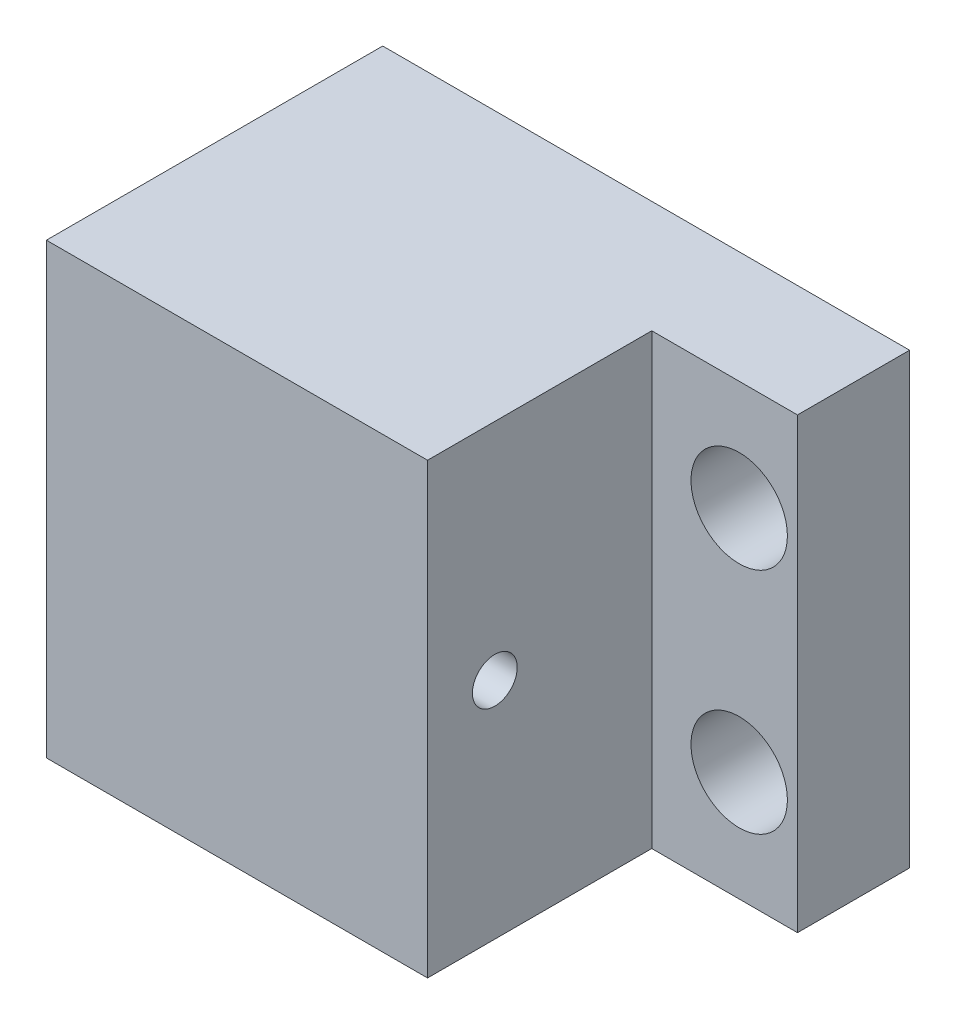
ISO-10303-21;
HEADER;
FILE_DESCRIPTION(('STEP AP214'),'2;1');
FILE_NAME('part.step','',(''),(''),'','','');
FILE_SCHEMA(('AUTOMOTIVE_DESIGN { 1 0 10303 214 1 1 1 1 }'));
ENDSEC;
DATA;
#1=APPLICATION_CONTEXT('core data for automotive mechanical design processes');
#2=APPLICATION_PROTOCOL_DEFINITION('international standard','automotive_design',2000,#1);
#3=PRODUCT_CONTEXT('',#1,'mechanical');
#4=PRODUCT('Part','Part','',(#3));
#5=PRODUCT_RELATED_PRODUCT_CATEGORY('part','',(#4));
#6=PRODUCT_DEFINITION_FORMATION('','',#4);
#7=PRODUCT_DEFINITION_CONTEXT('part definition',#1,'design');
#8=PRODUCT_DEFINITION('design','',#6,#7);
#9=PRODUCT_DEFINITION_SHAPE('','',#8);
#10=(LENGTH_UNIT() NAMED_UNIT(*) SI_UNIT(.MILLI.,.METRE.));
#11=(NAMED_UNIT(*) PLANE_ANGLE_UNIT() SI_UNIT($,.RADIAN.));
#12=(NAMED_UNIT(*) SI_UNIT($,.STERADIAN.) SOLID_ANGLE_UNIT());
#13=UNCERTAINTY_MEASURE_WITH_UNIT(LENGTH_MEASURE(1.E-05),#10,'distance_accuracy_value','');
#14=(GEOMETRIC_REPRESENTATION_CONTEXT(3) GLOBAL_UNCERTAINTY_ASSIGNED_CONTEXT((#13)) GLOBAL_UNIT_ASSIGNED_CONTEXT((#10,
#11,#12)) REPRESENTATION_CONTEXT('',''));
#15=CARTESIAN_POINT('',(0.,0.,0.));
#16=DIRECTION('',(0.,0.,1.));
#17=DIRECTION('',(1.,0.,0.));
#18=AXIS2_PLACEMENT_3D('',#15,#16,#17);
#19=CARTESIAN_POINT('',(0.,0.,5.));
#20=DIRECTION('',(0.,0.,-1.));
#21=DIRECTION('',(-1.,0.,0.));
#22=AXIS2_PLACEMENT_3D('',#19,#20,#21);
#23=PLANE('',#22);
#24=CARTESIAN_POINT('',(8.79749455337726,12.789651416122,5.));
#25=DIRECTION('',(0.,0.,1.));
#26=DIRECTION('',(1.,0.,0.));
#27=AXIS2_PLACEMENT_3D('',#24,#25,#26);
#28=CIRCLE('',#27,2.1499999999997);
#29=CARTESIAN_POINT('',(10.947494553377,12.789651416122,5.));
#30=VERTEX_POINT('',#29);
#31=EDGE_CURVE('E472',#30,#30,#28,.T.);
#32=ORIENTED_EDGE('',*,*,#31,.F.);
#33=EDGE_LOOP('',(#32));
#34=FACE_BOUND('',#33,.T.);
#35=CARTESIAN_POINT('',(8.79749455337726,22.989651416122,5.));
#36=DIRECTION('',(0.,0.,1.));
#37=DIRECTION('',(1.,0.,0.));
#38=AXIS2_PLACEMENT_3D('',#35,#36,#37);
#39=CIRCLE('',#38,2.1499999999997);
#40=CARTESIAN_POINT('',(10.947494553377,22.989651416122,5.));
#41=VERTEX_POINT('',#40);
#42=EDGE_CURVE('E466',#41,#41,#39,.T.);
#43=ORIENTED_EDGE('',*,*,#42,.F.);
#44=EDGE_LOOP('',(#43));
#45=FACE_BOUND('',#44,.T.);
#46=DIRECTION('',(0.,1.,0.));
#47=VECTOR('',#46,1.);
#48=CARTESIAN_POINT('',(4.89749455337726,7.88965141612197,5.));
#49=LINE('',#48,#47);
#50=CARTESIAN_POINT('',(4.89749455337726,7.88965141612197,5.));
#51=VERTEX_POINT('',#50);
#52=CARTESIAN_POINT('',(4.89749455337726,27.889651416122,5.));
#53=VERTEX_POINT('',#52);
#54=EDGE_CURVE('E48',#51,#53,#49,.T.);
#55=ORIENTED_EDGE('',*,*,#54,.F.);
#56=DIRECTION('',(1.,0.,0.));
#57=VECTOR('',#56,1.);
#58=CARTESIAN_POINT('',(-12.1025054466231,7.88965141612197,5.));
#59=LINE('',#58,#57);
#60=CARTESIAN_POINT('',(11.3974945533769,7.88965141612197,5.));
#61=VERTEX_POINT('',#60);
#62=EDGE_CURVE('E104',#51,#61,#59,.T.);
#63=ORIENTED_EDGE('',*,*,#62,.T.);
#64=DIRECTION('',(0.,1.,0.));
#65=VECTOR('',#64,1.);
#66=CARTESIAN_POINT('',(11.3974945533769,7.88965141612197,5.));
#67=LINE('',#66,#65);
#68=CARTESIAN_POINT('',(11.3974945533769,27.889651416122,5.));
#69=VERTEX_POINT('',#68);
#70=EDGE_CURVE('E211',#61,#69,#67,.T.);
#71=ORIENTED_EDGE('',*,*,#70,.T.);
#72=DIRECTION('',(-1.,0.,0.));
#73=VECTOR('',#72,1.);
#74=CARTESIAN_POINT('',(-12.1025054466231,27.889651416122,5.));
#75=LINE('',#74,#73);
#76=EDGE_CURVE('E260',#69,#53,#75,.T.);
#77=ORIENTED_EDGE('',*,*,#76,.T.);
#78=EDGE_LOOP('',(#55,#63,#71,#77));
#79=FACE_BOUND('',#78,.T.);
#80=ADVANCED_FACE('F33',(#34,#45,#79),#23,.F.);
#81=CARTESIAN_POINT('',(-12.1025054466231,7.88965141612197,5.));
#82=DIRECTION('',(0.,1.,0.));
#83=DIRECTION('',(0.,0.,1.));
#84=AXIS2_PLACEMENT_3D('',#81,#82,#83);
#85=PLANE('',#84);
#86=DIRECTION('',(1.,0.,0.));
#87=VECTOR('',#86,1.);
#88=CARTESIAN_POINT('',(-12.1025054466231,7.88965141612197,0.));
#89=LINE('',#88,#87);
#90=CARTESIAN_POINT('',(-12.1025054466231,7.88965141612197,0.));
#91=VERTEX_POINT('',#90);
#92=CARTESIAN_POINT('',(11.3974945533769,7.88965141612197,0.));
#93=VERTEX_POINT('',#92);
#94=EDGE_CURVE('E164',#91,#93,#89,.T.);
#95=ORIENTED_EDGE('',*,*,#94,.T.);
#96=DIRECTION('',(0.,0.,-1.));
#97=VECTOR('',#96,1.);
#98=CARTESIAN_POINT('',(11.3974945533769,7.88965141612197,5.));
#99=LINE('',#98,#97);
#100=EDGE_CURVE('E41',#61,#93,#99,.T.);
#101=ORIENTED_EDGE('',*,*,#100,.F.);
#102=ORIENTED_EDGE('',*,*,#62,.F.);
#103=DIRECTION('',(0.,0.,-1.));
#104=VECTOR('',#103,1.);
#105=CARTESIAN_POINT('',(4.89749455337726,7.88965141612197,15.));
#106=LINE('',#105,#104);
#107=CARTESIAN_POINT('',(4.89749455337726,7.88965141612197,15.));
#108=VERTEX_POINT('',#107);
#109=EDGE_CURVE('E165',#108,#51,#106,.T.);
#110=ORIENTED_EDGE('',*,*,#109,.F.);
#111=DIRECTION('',(1.,0.,0.));
#112=VECTOR('',#111,1.);
#113=CARTESIAN_POINT('',(-12.1025054466231,7.88965141612197,15.));
#114=LINE('',#113,#112);
#115=CARTESIAN_POINT('',(-12.1025054466231,7.88965141612197,15.));
#116=VERTEX_POINT('',#115);
#117=EDGE_CURVE('E236',#116,#108,#114,.T.);
#118=ORIENTED_EDGE('',*,*,#117,.F.);
#119=DIRECTION('',(0.,0.,-1.));
#120=VECTOR('',#119,1.);
#121=CARTESIAN_POINT('',(-12.1025054466231,7.88965141612197,5.));
#122=LINE('',#121,#120);
#123=EDGE_CURVE('E11',#116,#91,#122,.T.);
#124=ORIENTED_EDGE('',*,*,#123,.T.);
#125=EDGE_LOOP('',(#95,#101,#102,#110,#118,#124));
#126=FACE_BOUND('',#125,.T.);
#127=ADVANCED_FACE('F35',(#126),#85,.F.);
#128=CARTESIAN_POINT('',(11.3974945533769,7.88965141612197,5.));
#129=DIRECTION('',(-1.,0.,0.));
#130=DIRECTION('',(0.,0.,1.));
#131=AXIS2_PLACEMENT_3D('',#128,#129,#130);
#132=PLANE('',#131);
#133=DIRECTION('',(0.,1.,0.));
#134=VECTOR('',#133,1.);
#135=CARTESIAN_POINT('',(11.3974945533769,7.88965141612197,0.));
#136=LINE('',#135,#134);
#137=CARTESIAN_POINT('',(11.3974945533769,27.889651416122,0.));
#138=VERTEX_POINT('',#137);
#139=EDGE_CURVE('E167',#93,#138,#136,.T.);
#140=ORIENTED_EDGE('',*,*,#139,.T.);
#141=DIRECTION('',(0.,0.,-1.));
#142=VECTOR('',#141,1.);
#143=CARTESIAN_POINT('',(11.3974945533769,27.889651416122,5.));
#144=LINE('',#143,#142);
#145=EDGE_CURVE('E203',#69,#138,#144,.T.);
#146=ORIENTED_EDGE('',*,*,#145,.F.);
#147=ORIENTED_EDGE('',*,*,#70,.F.);
#148=ORIENTED_EDGE('',*,*,#100,.T.);
#149=EDGE_LOOP('',(#140,#146,#147,#148));
#150=FACE_BOUND('',#149,.T.);
#151=ADVANCED_FACE('F209',(#150),#132,.F.);
#152=CARTESIAN_POINT('',(-12.1025054466231,27.889651416122,5.));
#153=DIRECTION('',(0.,-1.,0.));
#154=DIRECTION('',(0.,0.,-1.));
#155=AXIS2_PLACEMENT_3D('',#152,#153,#154);
#156=PLANE('',#155);
#157=DIRECTION('',(-1.,0.,0.));
#158=VECTOR('',#157,1.);
#159=CARTESIAN_POINT('',(-12.1025054466231,27.889651416122,0.));
#160=LINE('',#159,#158);
#161=CARTESIAN_POINT('',(-12.1025054466231,27.889651416122,0.));
#162=VERTEX_POINT('',#161);
#163=EDGE_CURVE('E169',#138,#162,#160,.T.);
#164=ORIENTED_EDGE('',*,*,#163,.T.);
#165=DIRECTION('',(0.,0.,-1.));
#166=VECTOR('',#165,1.);
#167=CARTESIAN_POINT('',(-12.1025054466231,27.889651416122,5.));
#168=LINE('',#167,#166);
#169=CARTESIAN_POINT('',(-12.1025054466231,27.889651416122,15.));
#170=VERTEX_POINT('',#169);
#171=EDGE_CURVE('E200',#170,#162,#168,.T.);
#172=ORIENTED_EDGE('',*,*,#171,.F.);
#173=DIRECTION('',(-1.,0.,0.));
#174=VECTOR('',#173,1.);
#175=CARTESIAN_POINT('',(-12.1025054466231,27.889651416122,15.));
#176=LINE('',#175,#174);
#177=CARTESIAN_POINT('',(4.89749455337726,27.889651416122,15.));
#178=VERTEX_POINT('',#177);
#179=EDGE_CURVE('E248',#178,#170,#176,.T.);
#180=ORIENTED_EDGE('',*,*,#179,.F.);
#181=DIRECTION('',(0.,0.,-1.));
#182=VECTOR('',#181,1.);
#183=CARTESIAN_POINT('',(4.89749455337726,27.889651416122,15.));
#184=LINE('',#183,#182);
#185=EDGE_CURVE('E250',#178,#53,#184,.T.);
#186=ORIENTED_EDGE('',*,*,#185,.T.);
#187=ORIENTED_EDGE('',*,*,#76,.F.);
#188=ORIENTED_EDGE('',*,*,#145,.T.);
#189=EDGE_LOOP('',(#164,#172,#180,#186,#187,#188));
#190=FACE_BOUND('',#189,.T.);
#191=ADVANCED_FACE('F221',(#190),#156,.F.);
#192=CARTESIAN_POINT('',(-12.1025054466231,27.889651416122,5.));
#193=DIRECTION('',(1.,0.,0.));
#194=DIRECTION('',(0.,0.,-1.));
#195=AXIS2_PLACEMENT_3D('',#192,#193,#194);
#196=PLANE('',#195);
#197=CARTESIAN_POINT('',(-12.1025054466231,17.889651416122,11.9999999999991));
#198=DIRECTION('',(1.,0.,0.));
#199=DIRECTION('',(0.,0.,-1.));
#200=AXIS2_PLACEMENT_3D('',#197,#198,#199);
#201=CIRCLE('',#200,0.999999999999231);
#202=CARTESIAN_POINT('',(-12.1025054466231,17.889651416122,10.9999999999998));
#203=VERTEX_POINT('',#202);
#204=EDGE_CURVE('E252',#203,#203,#201,.T.);
#205=ORIENTED_EDGE('',*,*,#204,.T.);
#206=EDGE_LOOP('',(#205));
#207=FACE_BOUND('',#206,.T.);
#208=DIRECTION('',(0.,-1.,0.));
#209=VECTOR('',#208,1.);
#210=CARTESIAN_POINT('',(-12.1025054466231,27.889651416122,0.));
#211=LINE('',#210,#209);
#212=CARTESIAN_POINT('',(-12.1025054466231,26.889651416122,0.));
#213=VERTEX_POINT('',#212);
#214=EDGE_CURVE('E171',#162,#213,#211,.T.);
#215=ORIENTED_EDGE('',*,*,#214,.T.);
#216=DIRECTION('',(0.,0.,-1.));
#217=VECTOR('',#216,1.);
#218=CARTESIAN_POINT('',(-12.1025054466231,26.889651416122,5.));
#219=LINE('',#218,#217);
#220=CARTESIAN_POINT('',(-12.1025054466231,26.889651416122,5.));
#221=VERTEX_POINT('',#220);
#222=EDGE_CURVE('E197',#221,#213,#219,.T.);
#223=ORIENTED_EDGE('',*,*,#222,.F.);
#224=DIRECTION('',(0.,-1.,0.));
#225=VECTOR('',#224,1.);
#226=CARTESIAN_POINT('',(-12.1025054466231,7.88965141612197,5.));
#227=LINE('',#226,#225);
#228=CARTESIAN_POINT('',(-12.1025054466231,8.88965141612198,5.));
#229=VERTEX_POINT('',#228);
#230=EDGE_CURVE('E240',#221,#229,#227,.T.);
#231=ORIENTED_EDGE('',*,*,#230,.T.);
#232=DIRECTION('',(0.,0.,-1.));
#233=VECTOR('',#232,1.);
#234=CARTESIAN_POINT('',(-12.1025054466231,8.88965141612198,5.));
#235=LINE('',#234,#233);
#236=CARTESIAN_POINT('',(-12.1025054466231,8.88965141612198,0.));
#237=VERTEX_POINT('',#236);
#238=EDGE_CURVE('E57',#229,#237,#235,.T.);
#239=ORIENTED_EDGE('',*,*,#238,.T.);
#240=DIRECTION('',(0.,-1.,0.));
#241=VECTOR('',#240,1.);
#242=CARTESIAN_POINT('',(-12.1025054466231,7.88965141612197,0.));
#243=LINE('',#242,#241);
#244=EDGE_CURVE('E161',#237,#91,#243,.T.);
#245=ORIENTED_EDGE('',*,*,#244,.T.);
#246=ORIENTED_EDGE('',*,*,#123,.F.);
#247=DIRECTION('',(0.,-1.,0.));
#248=VECTOR('',#247,1.);
#249=CARTESIAN_POINT('',(-12.1025054466231,7.88965141612197,15.));
#250=LINE('',#249,#248);
#251=EDGE_CURVE('E230',#170,#116,#250,.T.);
#252=ORIENTED_EDGE('',*,*,#251,.F.);
#253=ORIENTED_EDGE('',*,*,#171,.T.);
#254=EDGE_LOOP('',(#215,#223,#231,#239,#245,#246,#252,#253));
#255=FACE_BOUND('',#254,.T.);
#256=ADVANCED_FACE('F227',(#207,#255),#196,.F.);
#257=CARTESIAN_POINT('',(-0.102505446623078,26.889651416122,5.));
#258=DIRECTION('',(0.,1.,0.));
#259=DIRECTION('',(0.,0.,1.));
#260=AXIS2_PLACEMENT_3D('',#257,#258,#259);
#261=PLANE('',#260);
#262=DIRECTION('',(1.,0.,0.));
#263=VECTOR('',#262,1.);
#264=CARTESIAN_POINT('',(-0.102505446623078,26.889651416122,0.));
#265=LINE('',#264,#263);
#266=CARTESIAN_POINT('',(-0.102505446623078,26.889651416122,0.));
#267=VERTEX_POINT('',#266);
#268=EDGE_CURVE('E173',#213,#267,#265,.T.);
#269=ORIENTED_EDGE('',*,*,#268,.T.);
#270=DIRECTION('',(0.,0.,-1.));
#271=VECTOR('',#270,1.);
#272=CARTESIAN_POINT('',(-0.102505446623078,26.889651416122,5.));
#273=LINE('',#272,#271);
#274=CARTESIAN_POINT('',(-0.102505446623078,26.889651416122,5.));
#275=VERTEX_POINT('',#274);
#276=EDGE_CURVE('E194',#275,#267,#273,.T.);
#277=ORIENTED_EDGE('',*,*,#276,.F.);
#278=DIRECTION('',(1.,0.,0.));
#279=VECTOR('',#278,1.);
#280=CARTESIAN_POINT('',(-0.102505446623078,26.889651416122,5.));
#281=LINE('',#280,#279);
#282=EDGE_CURVE('E262',#221,#275,#281,.T.);
#283=ORIENTED_EDGE('',*,*,#282,.F.);
#284=ORIENTED_EDGE('',*,*,#222,.T.);
#285=EDGE_LOOP('',(#269,#277,#283,#284));
#286=FACE_BOUND('',#285,.T.);
#287=ADVANCED_FACE('F278',(#286),#261,.F.);
#288=CARTESIAN_POINT('',(-0.102505446622967,22.9886709297148,5.));
#289=DIRECTION('',(1.,0.,0.));
#290=DIRECTION('',(0.,1.,0.));
#291=AXIS2_PLACEMENT_3D('',#288,#289,#290);
#292=PLANE('',#291);
#293=DIRECTION('',(0.,-1.,0.));
#294=VECTOR('',#293,1.);
#295=CARTESIAN_POINT('',(-0.102505446622967,22.9886709297148,0.));
#296=LINE('',#295,#294);
#297=CARTESIAN_POINT('',(-0.102505446622967,22.9886709297148,0.));
#298=VERTEX_POINT('',#297);
#299=EDGE_CURVE('E175',#267,#298,#296,.T.);
#300=ORIENTED_EDGE('',*,*,#299,.T.);
#301=DIRECTION('',(0.,0.,-1.));
#302=VECTOR('',#301,1.);
#303=CARTESIAN_POINT('',(-0.102505446622967,22.9886709297148,5.));
#304=LINE('',#303,#302);
#305=CARTESIAN_POINT('',(-0.102505446622967,22.9886709297148,5.));
#306=VERTEX_POINT('',#305);
#307=EDGE_CURVE('E191',#306,#298,#304,.T.);
#308=ORIENTED_EDGE('',*,*,#307,.F.);
#309=DIRECTION('',(0.,-1.,0.));
#310=VECTOR('',#309,1.);
#311=CARTESIAN_POINT('',(-0.102505446622967,22.9886709297148,5.));
#312=LINE('',#311,#310);
#313=EDGE_CURVE('E265',#275,#306,#312,.T.);
#314=ORIENTED_EDGE('',*,*,#313,.F.);
#315=ORIENTED_EDGE('',*,*,#276,.T.);
#316=EDGE_LOOP('',(#300,#308,#314,#315));
#317=FACE_BOUND('',#316,.T.);
#318=ADVANCED_FACE('F281',(#317),#292,.F.);
#319=CARTESIAN_POINT('',(1.89749455337692,22.9886709297148,5.));
#320=DIRECTION('',(0.,1.,0.));
#321=DIRECTION('',(0.,0.,1.));
#322=AXIS2_PLACEMENT_3D('',#319,#320,#321);
#323=PLANE('',#322);
#324=DIRECTION('',(1.,0.,0.));
#325=VECTOR('',#324,1.);
#326=CARTESIAN_POINT('',(1.89749455337692,22.9886709297148,0.));
#327=LINE('',#326,#325);
#328=CARTESIAN_POINT('',(1.89749455337692,22.9886709297148,0.));
#329=VERTEX_POINT('',#328);
#330=EDGE_CURVE('E177',#298,#329,#327,.T.);
#331=ORIENTED_EDGE('',*,*,#330,.T.);
#332=DIRECTION('',(0.,0.,-1.));
#333=VECTOR('',#332,1.);
#334=CARTESIAN_POINT('',(1.89749455337692,22.9886709297148,5.));
#335=LINE('',#334,#333);
#336=CARTESIAN_POINT('',(1.89749455337692,22.9886709297148,5.));
#337=VERTEX_POINT('',#336);
#338=EDGE_CURVE('E188',#337,#329,#335,.T.);
#339=ORIENTED_EDGE('',*,*,#338,.F.);
#340=DIRECTION('',(1.,0.,0.));
#341=VECTOR('',#340,1.);
#342=CARTESIAN_POINT('',(1.89749455337692,22.9886709297148,5.));
#343=LINE('',#342,#341);
#344=EDGE_CURVE('E156',#306,#337,#343,.T.);
#345=ORIENTED_EDGE('',*,*,#344,.F.);
#346=ORIENTED_EDGE('',*,*,#307,.T.);
#347=EDGE_LOOP('',(#331,#339,#345,#346));
#348=FACE_BOUND('',#347,.T.);
#349=ADVANCED_FACE('F270',(#348),#323,.F.);
#350=CARTESIAN_POINT('',(1.89749455337692,12.7906319025292,5.));
#351=DIRECTION('',(1.,0.,0.));
#352=DIRECTION('',(0.,0.,-1.));
#353=AXIS2_PLACEMENT_3D('',#350,#351,#352);
#354=PLANE('',#353);
#355=DIRECTION('',(0.,-1.,0.));
#356=VECTOR('',#355,1.);
#357=CARTESIAN_POINT('',(1.89749455337692,12.7906319025292,0.));
#358=LINE('',#357,#356);
#359=CARTESIAN_POINT('',(1.89749455337692,12.7906319025292,0.));
#360=VERTEX_POINT('',#359);
#361=EDGE_CURVE('E179',#329,#360,#358,.T.);
#362=ORIENTED_EDGE('',*,*,#361,.T.);
#363=DIRECTION('',(0.,0.,-1.));
#364=VECTOR('',#363,1.);
#365=CARTESIAN_POINT('',(1.89749455337692,12.7906319025292,5.));
#366=LINE('',#365,#364);
#367=CARTESIAN_POINT('',(1.89749455337692,12.7906319025292,5.));
#368=VERTEX_POINT('',#367);
#369=EDGE_CURVE('E141',#368,#360,#366,.T.);
#370=ORIENTED_EDGE('',*,*,#369,.F.);
#371=DIRECTION('',(0.,-1.,0.));
#372=VECTOR('',#371,1.);
#373=CARTESIAN_POINT('',(1.89749455337692,12.7906319025292,5.));
#374=LINE('',#373,#372);
#375=EDGE_CURVE('E154',#337,#368,#374,.T.);
#376=ORIENTED_EDGE('',*,*,#375,.F.);
#377=ORIENTED_EDGE('',*,*,#338,.T.);
#378=EDGE_LOOP('',(#362,#370,#376,#377));
#379=FACE_BOUND('',#378,.T.);
#380=ADVANCED_FACE('F274',(#379),#354,.F.);
#381=CARTESIAN_POINT('',(-0.102505446623075,12.7906319025292,5.));
#382=DIRECTION('',(0.,-1.,0.));
#383=DIRECTION('',(0.,0.,-1.));
#384=AXIS2_PLACEMENT_3D('',#381,#382,#383);
#385=PLANE('',#384);
#386=DIRECTION('',(-1.,0.,0.));
#387=VECTOR('',#386,1.);
#388=CARTESIAN_POINT('',(-0.102505446623075,12.7906319025292,0.));
#389=LINE('',#388,#387);
#390=CARTESIAN_POINT('',(-0.102505446623075,12.7906319025292,0.));
#391=VERTEX_POINT('',#390);
#392=EDGE_CURVE('E137',#360,#391,#389,.T.);
#393=ORIENTED_EDGE('',*,*,#392,.T.);
#394=DIRECTION('',(0.,0.,-1.));
#395=VECTOR('',#394,1.);
#396=CARTESIAN_POINT('',(-0.102505446623075,12.7906319025292,5.));
#397=LINE('',#396,#395);
#398=CARTESIAN_POINT('',(-0.102505446623075,12.7906319025292,5.));
#399=VERTEX_POINT('',#398);
#400=EDGE_CURVE('E129',#399,#391,#397,.T.);
#401=ORIENTED_EDGE('',*,*,#400,.F.);
#402=DIRECTION('',(-1.,0.,0.));
#403=VECTOR('',#402,1.);
#404=CARTESIAN_POINT('',(-0.102505446623075,12.7906319025292,5.));
#405=LINE('',#404,#403);
#406=EDGE_CURVE('E134',#368,#399,#405,.T.);
#407=ORIENTED_EDGE('',*,*,#406,.F.);
#408=ORIENTED_EDGE('',*,*,#369,.T.);
#409=EDGE_LOOP('',(#393,#401,#407,#408));
#410=FACE_BOUND('',#409,.T.);
#411=ADVANCED_FACE('F131',(#410),#385,.F.);
#412=CARTESIAN_POINT('',(-0.102505446623073,8.88965141612198,5.));
#413=DIRECTION('',(1.,0.,0.));
#414=DIRECTION('',(0.,1.,0.));
#415=AXIS2_PLACEMENT_3D('',#412,#413,#414);
#416=PLANE('',#415);
#417=DIRECTION('',(0.,-1.,0.));
#418=VECTOR('',#417,1.);
#419=CARTESIAN_POINT('',(-0.102505446623073,8.88965141612198,0.));
#420=LINE('',#419,#418);
#421=CARTESIAN_POINT('',(-0.102505446623073,8.88965141612198,0.));
#422=VERTEX_POINT('',#421);
#423=EDGE_CURVE('E182',#391,#422,#420,.T.);
#424=ORIENTED_EDGE('',*,*,#423,.T.);
#425=DIRECTION('',(0.,0.,-1.));
#426=VECTOR('',#425,1.);
#427=CARTESIAN_POINT('',(-0.102505446623073,8.88965141612198,5.));
#428=LINE('',#427,#426);
#429=CARTESIAN_POINT('',(-0.102505446623073,8.88965141612198,5.));
#430=VERTEX_POINT('',#429);
#431=EDGE_CURVE('E142',#430,#422,#428,.T.);
#432=ORIENTED_EDGE('',*,*,#431,.F.);
#433=DIRECTION('',(0.,-1.,0.));
#434=VECTOR('',#433,1.);
#435=CARTESIAN_POINT('',(-0.102505446623073,8.88965141612198,5.));
#436=LINE('',#435,#434);
#437=EDGE_CURVE('E145',#399,#430,#436,.T.);
#438=ORIENTED_EDGE('',*,*,#437,.F.);
#439=ORIENTED_EDGE('',*,*,#400,.T.);
#440=EDGE_LOOP('',(#424,#432,#438,#439));
#441=FACE_BOUND('',#440,.T.);
#442=ADVANCED_FACE('F146',(#441),#416,.F.);
#443=CARTESIAN_POINT('',(-12.1025054466231,8.88965141612198,5.));
#444=DIRECTION('',(0.,-1.,0.));
#445=DIRECTION('',(1.,0.,0.));
#446=AXIS2_PLACEMENT_3D('',#443,#444,#445);
#447=PLANE('',#446);
#448=DIRECTION('',(-1.,0.,0.));
#449=VECTOR('',#448,1.);
#450=CARTESIAN_POINT('',(-12.1025054466231,8.88965141612198,0.));
#451=LINE('',#450,#449);
#452=EDGE_CURVE('E100',#422,#237,#451,.T.);
#453=ORIENTED_EDGE('',*,*,#452,.T.);
#454=ORIENTED_EDGE('',*,*,#238,.F.);
#455=DIRECTION('',(-1.,0.,0.));
#456=VECTOR('',#455,1.);
#457=CARTESIAN_POINT('',(-1.10250544662306,8.88965141612198,5.));
#458=LINE('',#457,#456);
#459=EDGE_CURVE('E148',#430,#229,#458,.T.);
#460=ORIENTED_EDGE('',*,*,#459,.F.);
#461=ORIENTED_EDGE('',*,*,#431,.T.);
#462=EDGE_LOOP('',(#453,#454,#460,#461));
#463=FACE_BOUND('',#462,.T.);
#464=ADVANCED_FACE('F275',(#463),#447,.F.);
#465=CARTESIAN_POINT('',(0.,0.,0.));
#466=DIRECTION('',(0.,0.,-1.));
#467=DIRECTION('',(-1.,0.,0.));
#468=AXIS2_PLACEMENT_3D('',#465,#466,#467);
#469=PLANE('',#468);
#470=CARTESIAN_POINT('',(8.79749455337726,12.789651416122,0.));
#471=DIRECTION('',(0.,0.,1.));
#472=DIRECTION('',(1.,0.,0.));
#473=AXIS2_PLACEMENT_3D('',#470,#471,#472);
#474=CIRCLE('',#473,2.1499999999997);
#475=CARTESIAN_POINT('',(10.947494553377,12.789651416122,0.));
#476=VERTEX_POINT('',#475);
#477=EDGE_CURVE('E464',#476,#476,#474,.T.);
#478=ORIENTED_EDGE('',*,*,#477,.T.);
#479=EDGE_LOOP('',(#478));
#480=FACE_BOUND('',#479,.T.);
#481=CARTESIAN_POINT('',(8.79749455337726,22.989651416122,0.));
#482=DIRECTION('',(0.,0.,1.));
#483=DIRECTION('',(1.,0.,0.));
#484=AXIS2_PLACEMENT_3D('',#481,#482,#483);
#485=CIRCLE('',#484,2.1499999999997);
#486=CARTESIAN_POINT('',(10.947494553377,22.989651416122,0.));
#487=VERTEX_POINT('',#486);
#488=EDGE_CURVE('E469',#487,#487,#485,.T.);
#489=ORIENTED_EDGE('',*,*,#488,.T.);
#490=EDGE_LOOP('',(#489));
#491=FACE_BOUND('',#490,.T.);
#492=ORIENTED_EDGE('',*,*,#244,.F.);
#493=ORIENTED_EDGE('',*,*,#452,.F.);
#494=ORIENTED_EDGE('',*,*,#423,.F.);
#495=ORIENTED_EDGE('',*,*,#392,.F.);
#496=ORIENTED_EDGE('',*,*,#361,.F.);
#497=ORIENTED_EDGE('',*,*,#330,.F.);
#498=ORIENTED_EDGE('',*,*,#299,.F.);
#499=ORIENTED_EDGE('',*,*,#268,.F.);
#500=ORIENTED_EDGE('',*,*,#214,.F.);
#501=ORIENTED_EDGE('',*,*,#163,.F.);
#502=ORIENTED_EDGE('',*,*,#139,.F.);
#503=ORIENTED_EDGE('',*,*,#94,.F.);
#504=EDGE_LOOP('',(#492,#493,#494,#495,#496,#497,#498,#499,#500,#501,#502,#503));
#505=FACE_BOUND('',#504,.T.);
#506=ADVANCED_FACE('F216',(#480,#491,#505),#469,.T.);
#507=CARTESIAN_POINT('',(4.89749455337726,7.88965141612197,15.));
#508=DIRECTION('',(-1.,0.,0.));
#509=DIRECTION('',(0.,0.,1.));
#510=AXIS2_PLACEMENT_3D('',#507,#508,#509);
#511=PLANE('',#510);
#512=CARTESIAN_POINT('',(4.89749455337726,17.889651416122,11.9999999999991));
#513=DIRECTION('',(1.,0.,0.));
#514=DIRECTION('',(0.,0.,-1.));
#515=AXIS2_PLACEMENT_3D('',#512,#513,#514);
#516=CIRCLE('',#515,0.999999999999231);
#517=CARTESIAN_POINT('',(4.89749455337726,17.889651416122,10.9999999999998));
#518=VERTEX_POINT('',#517);
#519=EDGE_CURVE('E243',#518,#518,#516,.T.);
#520=ORIENTED_EDGE('',*,*,#519,.F.);
#521=EDGE_LOOP('',(#520));
#522=FACE_BOUND('',#521,.T.);
#523=ORIENTED_EDGE('',*,*,#54,.T.);
#524=ORIENTED_EDGE('',*,*,#185,.F.);
#525=DIRECTION('',(0.,1.,0.));
#526=VECTOR('',#525,1.);
#527=CARTESIAN_POINT('',(4.89749455337726,7.88965141612197,15.));
#528=LINE('',#527,#526);
#529=EDGE_CURVE('E238',#108,#178,#528,.T.);
#530=ORIENTED_EDGE('',*,*,#529,.F.);
#531=ORIENTED_EDGE('',*,*,#109,.T.);
#532=EDGE_LOOP('',(#523,#524,#530,#531));
#533=FACE_BOUND('',#532,.T.);
#534=ADVANCED_FACE('F300',(#522,#533),#511,.F.);
#535=CARTESIAN_POINT('',(0.,0.,15.));
#536=DIRECTION('',(0.,0.,-1.));
#537=DIRECTION('',(-1.,0.,0.));
#538=AXIS2_PLACEMENT_3D('',#535,#536,#537);
#539=PLANE('',#538);
#540=ORIENTED_EDGE('',*,*,#251,.T.);
#541=ORIENTED_EDGE('',*,*,#117,.T.);
#542=ORIENTED_EDGE('',*,*,#529,.T.);
#543=ORIENTED_EDGE('',*,*,#179,.T.);
#544=EDGE_LOOP('',(#540,#541,#542,#543));
#545=FACE_BOUND('',#544,.T.);
#546=ADVANCED_FACE('F340',(#545),#539,.F.);
#547=CARTESIAN_POINT('',(0.,0.,5.));
#548=DIRECTION('',(0.,0.,-1.));
#549=DIRECTION('',(-1.,0.,0.));
#550=AXIS2_PLACEMENT_3D('',#547,#548,#549);
#551=PLANE('',#550);
#552=ORIENTED_EDGE('',*,*,#230,.F.);
#553=ORIENTED_EDGE('',*,*,#282,.T.);
#554=ORIENTED_EDGE('',*,*,#313,.T.);
#555=ORIENTED_EDGE('',*,*,#344,.T.);
#556=ORIENTED_EDGE('',*,*,#375,.T.);
#557=ORIENTED_EDGE('',*,*,#406,.T.);
#558=ORIENTED_EDGE('',*,*,#437,.T.);
#559=ORIENTED_EDGE('',*,*,#459,.T.);
#560=EDGE_LOOP('',(#552,#553,#554,#555,#556,#557,#558,#559));
#561=FACE_BOUND('',#560,.T.);
#562=ADVANCED_FACE('F151',(#561),#551,.T.);
#563=CARTESIAN_POINT('',(-12.1025054466231,17.889651416122,11.9999999999991));
#564=DIRECTION('',(1.,0.,0.));
#565=DIRECTION('',(0.,0.,-1.));
#566=AXIS2_PLACEMENT_3D('',#563,#564,#565);
#567=CYLINDRICAL_SURFACE('',#566,0.999999999999231);
#568=ORIENTED_EDGE('',*,*,#204,.F.);
#569=EDGE_LOOP('',(#568));
#570=FACE_BOUND('',#569,.T.);
#571=ORIENTED_EDGE('',*,*,#519,.T.);
#572=EDGE_LOOP('',(#571));
#573=FACE_BOUND('',#572,.T.);
#574=ADVANCED_FACE('F354',(#570,#573),#567,.F.);
#575=CARTESIAN_POINT('',(8.79749455337726,22.989651416122,0.));
#576=DIRECTION('',(0.,0.,1.));
#577=DIRECTION('',(1.,0.,0.));
#578=AXIS2_PLACEMENT_3D('',#575,#576,#577);
#579=CYLINDRICAL_SURFACE('',#578,2.1499999999997);
#580=ORIENTED_EDGE('',*,*,#488,.F.);
#581=EDGE_LOOP('',(#580));
#582=FACE_BOUND('',#581,.T.);
#583=ORIENTED_EDGE('',*,*,#42,.T.);
#584=EDGE_LOOP('',(#583));
#585=FACE_BOUND('',#584,.T.);
#586=ADVANCED_FACE('F359',(#582,#585),#579,.F.);
#587=CARTESIAN_POINT('',(8.79749455337726,12.789651416122,0.));
#588=DIRECTION('',(0.,0.,1.));
#589=DIRECTION('',(1.,0.,0.));
#590=AXIS2_PLACEMENT_3D('',#587,#588,#589);
#591=CYLINDRICAL_SURFACE('',#590,2.1499999999997);
#592=ORIENTED_EDGE('',*,*,#477,.F.);
#593=EDGE_LOOP('',(#592));
#594=FACE_BOUND('',#593,.T.);
#595=ORIENTED_EDGE('',*,*,#31,.T.);
#596=EDGE_LOOP('',(#595));
#597=FACE_BOUND('',#596,.T.);
#598=ADVANCED_FACE('F366',(#594,#597),#591,.F.);
#599=CLOSED_SHELL('',(#80,#127,#151,#191,#256,#287,#318,#349,#380,#411,#442,#464,#506,#534,#546,
#562,#574,#586,#598));
#600=MANIFOLD_SOLID_BREP('B2',#599);
#601=ADVANCED_BREP_SHAPE_REPRESENTATION('',(#18,#600),#14);
#602=SHAPE_DEFINITION_REPRESENTATION(#9,#601);
ENDSEC;
END-ISO-10303-21;
